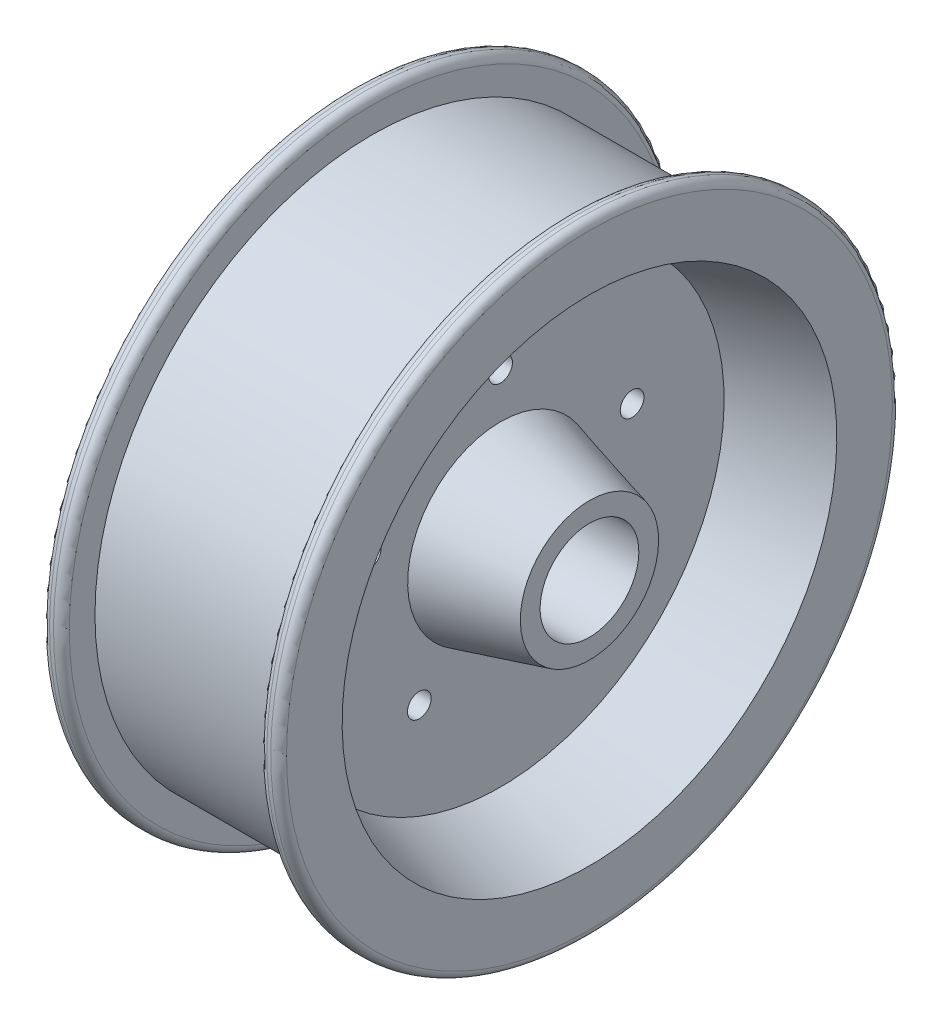
ISO-10303-21;
HEADER;
FILE_DESCRIPTION(('STEP AP214'),'2;1');
FILE_NAME('part.step','',(''),(''),'','','');
FILE_SCHEMA(('AUTOMOTIVE_DESIGN { 1 0 10303 214 1 1 1 1 }'));
ENDSEC;
DATA;
#1=APPLICATION_CONTEXT('core data for automotive mechanical design processes');
#2=APPLICATION_PROTOCOL_DEFINITION('international standard','automotive_design',2000,#1);
#3=PRODUCT_CONTEXT('',#1,'mechanical');
#4=PRODUCT('Part','Part','',(#3));
#5=PRODUCT_RELATED_PRODUCT_CATEGORY('part','',(#4));
#6=PRODUCT_DEFINITION_FORMATION('','',#4);
#7=PRODUCT_DEFINITION_CONTEXT('part definition',#1,'design');
#8=PRODUCT_DEFINITION('design','',#6,#7);
#9=PRODUCT_DEFINITION_SHAPE('','',#8);
#10=(LENGTH_UNIT() NAMED_UNIT(*) SI_UNIT(.MILLI.,.METRE.));
#11=(NAMED_UNIT(*) PLANE_ANGLE_UNIT() SI_UNIT($,.RADIAN.));
#12=(NAMED_UNIT(*) SI_UNIT($,.STERADIAN.) SOLID_ANGLE_UNIT());
#13=UNCERTAINTY_MEASURE_WITH_UNIT(LENGTH_MEASURE(1.E-05),#10,'distance_accuracy_value','');
#14=(GEOMETRIC_REPRESENTATION_CONTEXT(3) GLOBAL_UNCERTAINTY_ASSIGNED_CONTEXT((#13)) GLOBAL_UNIT_ASSIGNED_CONTEXT((#10,
#11,#12)) REPRESENTATION_CONTEXT('',''));
#15=CARTESIAN_POINT('',(0.,0.,0.));
#16=DIRECTION('',(0.,0.,1.));
#17=DIRECTION('',(1.,0.,0.));
#18=AXIS2_PLACEMENT_3D('',#15,#16,#17);
#19=CARTESIAN_POINT('',(38.1,0.,0.));
#20=DIRECTION('',(1.,0.,0.));
#21=DIRECTION('',(0.,1.,0.));
#22=AXIS2_PLACEMENT_3D('',#19,#20,#21);
#23=PLANE('',#22);
#24=CARTESIAN_POINT('',(38.1,20.9836180679051,0.));
#25=DIRECTION('',(1.,0.,0.));
#26=DIRECTION('',(0.,1.,0.));
#27=AXIS2_PLACEMENT_3D('',#24,#25,#26);
#28=CIRCLE('',#27,97.4049729017436);
#29=CARTESIAN_POINT('',(38.1,118.388590969649,0.));
#30=VERTEX_POINT('',#29);
#31=EDGE_CURVE('E10',#30,#30,#28,.T.);
#32=ORIENTED_EDGE('',*,*,#31,.T.);
#33=EDGE_LOOP('',(#32));
#34=FACE_BOUND('',#33,.T.);
#35=CARTESIAN_POINT('',(38.1,20.9836180679051,0.));
#36=DIRECTION('',(1.,0.,0.));
#37=DIRECTION('',(0.,1.,0.));
#38=AXIS2_PLACEMENT_3D('',#35,#36,#37);
#39=CIRCLE('',#38,79.5274);
#40=CARTESIAN_POINT('',(38.1,100.511018067905,0.));
#41=VERTEX_POINT('',#40);
#42=EDGE_CURVE('E120',#41,#41,#39,.T.);
#43=ORIENTED_EDGE('',*,*,#42,.F.);
#44=EDGE_LOOP('',(#43));
#45=FACE_BOUND('',#44,.T.);
#46=ADVANCED_FACE('F37',(#34,#45),#23,.T.);
#47=CARTESIAN_POINT('',(35.56,20.9836180679051,0.));
#48=DIRECTION('',(1.,0.,0.));
#49=DIRECTION('',(0.,1.,0.));
#50=AXIS2_PLACEMENT_3D('',#47,#48,#49);
#51=TOROIDAL_SURFACE('',#50,97.4049729017436,2.54);
#52=CARTESIAN_POINT('',(35.56,20.9836180679051,0.));
#53=DIRECTION('',(1.,0.,0.));
#54=DIRECTION('',(0.,1.,0.));
#55=AXIS2_PLACEMENT_3D('',#52,#53,#54);
#56=CIRCLE('',#55,99.9449729017436);
#57=CARTESIAN_POINT('',(35.56,120.928590969649,0.));
#58=VERTEX_POINT('',#57);
#59=EDGE_CURVE('E44',#58,#58,#56,.T.);
#60=ORIENTED_EDGE('',*,*,#59,.T.);
#61=EDGE_LOOP('',(#60));
#62=FACE_BOUND('',#61,.T.);
#63=ORIENTED_EDGE('',*,*,#31,.F.);
#64=EDGE_LOOP('',(#63));
#65=FACE_BOUND('',#64,.T.);
#66=ADVANCED_FACE('F216',(#62,#65),#51,.T.);
#67=CARTESIAN_POINT('',(104.969478070492,20.9836180679051,0.));
#68=DIRECTION('',(1.,0.,0.));
#69=DIRECTION('',(0.,1.,0.));
#70=AXIS2_PLACEMENT_3D('',#67,#68,#69);
#71=CYLINDRICAL_SURFACE('',#70,99.9449729017436);
#72=CARTESIAN_POINT('',(34.29,20.9836180679051,0.));
#73=DIRECTION('',(1.,0.,0.));
#74=DIRECTION('',(0.,1.,0.));
#75=AXIS2_PLACEMENT_3D('',#72,#73,#74);
#76=CIRCLE('',#75,99.9449729017436);
#77=CARTESIAN_POINT('',(34.29,120.928590969649,0.));
#78=VERTEX_POINT('',#77);
#79=EDGE_CURVE('E49',#78,#78,#76,.T.);
#80=ORIENTED_EDGE('',*,*,#79,.T.);
#81=EDGE_LOOP('',(#80));
#82=FACE_BOUND('',#81,.T.);
#83=ORIENTED_EDGE('',*,*,#59,.F.);
#84=EDGE_LOOP('',(#83));
#85=FACE_BOUND('',#84,.T.);
#86=ADVANCED_FACE('F220',(#82,#85),#71,.T.);
#87=CARTESIAN_POINT('',(34.29,20.9836180679051,0.));
#88=DIRECTION('',(1.,0.,0.));
#89=DIRECTION('',(0.,1.,0.));
#90=AXIS2_PLACEMENT_3D('',#87,#88,#89);
#91=TOROIDAL_SURFACE('',#90,97.4049729017436,2.54);
#92=CARTESIAN_POINT('',(31.75,20.9836180679051,0.));
#93=DIRECTION('',(1.,0.,0.));
#94=DIRECTION('',(0.,1.,0.));
#95=AXIS2_PLACEMENT_3D('',#92,#93,#94);
#96=CIRCLE('',#95,97.4049729017436);
#97=CARTESIAN_POINT('',(31.75,118.388590969649,0.));
#98=VERTEX_POINT('',#97);
#99=EDGE_CURVE('E54',#98,#98,#96,.T.);
#100=ORIENTED_EDGE('',*,*,#99,.T.);
#101=EDGE_LOOP('',(#100));
#102=FACE_BOUND('',#101,.T.);
#103=ORIENTED_EDGE('',*,*,#79,.F.);
#104=EDGE_LOOP('',(#103));
#105=FACE_BOUND('',#104,.T.);
#106=ADVANCED_FACE('F386',(#102,#105),#91,.T.);
#107=CARTESIAN_POINT('',(31.75,0.,0.));
#108=DIRECTION('',(-1.,0.,0.));
#109=DIRECTION('',(0.,-1.,0.));
#110=AXIS2_PLACEMENT_3D('',#107,#108,#109);
#111=PLANE('',#110);
#112=CARTESIAN_POINT('',(31.75,20.9836180679051,0.));
#113=DIRECTION('',(1.,0.,0.));
#114=DIRECTION('',(0.,1.,0.));
#115=AXIS2_PLACEMENT_3D('',#112,#113,#114);
#116=CIRCLE('',#115,89.1499729017436);
#117=CARTESIAN_POINT('',(31.75,110.133590969649,0.));
#118=VERTEX_POINT('',#117);
#119=EDGE_CURVE('E60',#118,#118,#116,.T.);
#120=ORIENTED_EDGE('',*,*,#119,.T.);
#121=EDGE_LOOP('',(#120));
#122=FACE_BOUND('',#121,.T.);
#123=ORIENTED_EDGE('',*,*,#99,.F.);
#124=EDGE_LOOP('',(#123));
#125=FACE_BOUND('',#124,.T.);
#126=ADVANCED_FACE('F376',(#122,#125),#111,.T.);
#127=CARTESIAN_POINT('',(104.969478070492,20.9836180679051,0.));
#128=DIRECTION('',(1.,0.,0.));
#129=DIRECTION('',(0.,1.,0.));
#130=AXIS2_PLACEMENT_3D('',#127,#128,#129);
#131=CYLINDRICAL_SURFACE('',#130,89.1499729017436);
#132=CARTESIAN_POINT('',(-31.75,20.9836180679051,0.));
#133=DIRECTION('',(1.,0.,0.));
#134=DIRECTION('',(0.,1.,0.));
#135=AXIS2_PLACEMENT_3D('',#132,#133,#134);
#136=CIRCLE('',#135,89.1499729017436);
#137=CARTESIAN_POINT('',(-31.75,110.133590969649,0.));
#138=VERTEX_POINT('',#137);
#139=EDGE_CURVE('E64',#138,#138,#136,.T.);
#140=ORIENTED_EDGE('',*,*,#139,.T.);
#141=EDGE_LOOP('',(#140));
#142=FACE_BOUND('',#141,.T.);
#143=ORIENTED_EDGE('',*,*,#119,.F.);
#144=EDGE_LOOP('',(#143));
#145=FACE_BOUND('',#144,.T.);
#146=ADVANCED_FACE('F366',(#142,#145),#131,.T.);
#147=CARTESIAN_POINT('',(-31.75,0.,0.));
#148=DIRECTION('',(-1.,0.,0.));
#149=DIRECTION('',(0.,-1.,0.));
#150=AXIS2_PLACEMENT_3D('',#147,#148,#149);
#151=PLANE('',#150);
#152=ORIENTED_EDGE('',*,*,#139,.F.);
#153=EDGE_LOOP('',(#152));
#154=FACE_BOUND('',#153,.T.);
#155=CARTESIAN_POINT('',(-31.75,20.9836180679051,0.));
#156=DIRECTION('',(1.,0.,0.));
#157=DIRECTION('',(0.,1.,0.));
#158=AXIS2_PLACEMENT_3D('',#155,#156,#157);
#159=CIRCLE('',#158,97.4049729017436);
#160=CARTESIAN_POINT('',(-31.75,118.388590969649,0.));
#161=VERTEX_POINT('',#160);
#162=EDGE_CURVE('E68',#161,#161,#159,.T.);
#163=ORIENTED_EDGE('',*,*,#162,.T.);
#164=EDGE_LOOP('',(#163));
#165=FACE_BOUND('',#164,.T.);
#166=ADVANCED_FACE('F356',(#154,#165),#151,.F.);
#167=CARTESIAN_POINT('',(-34.29,20.9836180679051,0.));
#168=DIRECTION('',(1.,0.,0.));
#169=DIRECTION('',(0.,1.,0.));
#170=AXIS2_PLACEMENT_3D('',#167,#168,#169);
#171=TOROIDAL_SURFACE('',#170,97.4049729017436,2.54);
#172=ORIENTED_EDGE('',*,*,#162,.F.);
#173=EDGE_LOOP('',(#172));
#174=FACE_BOUND('',#173,.T.);
#175=CARTESIAN_POINT('',(-34.29,20.9836180679051,0.));
#176=DIRECTION('',(1.,0.,0.));
#177=DIRECTION('',(0.,1.,0.));
#178=AXIS2_PLACEMENT_3D('',#175,#176,#177);
#179=CIRCLE('',#178,99.9449729017436);
#180=CARTESIAN_POINT('',(-34.29,120.928590969649,0.));
#181=VERTEX_POINT('',#180);
#182=EDGE_CURVE('E72',#181,#181,#179,.T.);
#183=ORIENTED_EDGE('',*,*,#182,.T.);
#184=EDGE_LOOP('',(#183));
#185=FACE_BOUND('',#184,.T.);
#186=ADVANCED_FACE('F346',(#174,#185),#171,.T.);
#187=CARTESIAN_POINT('',(104.969478070492,20.9836180679051,0.));
#188=DIRECTION('',(1.,0.,0.));
#189=DIRECTION('',(0.,1.,0.));
#190=AXIS2_PLACEMENT_3D('',#187,#188,#189);
#191=CYLINDRICAL_SURFACE('',#190,99.9449729017436);
#192=ORIENTED_EDGE('',*,*,#182,.F.);
#193=EDGE_LOOP('',(#192));
#194=FACE_BOUND('',#193,.T.);
#195=CARTESIAN_POINT('',(-35.56,20.9836180679051,0.));
#196=DIRECTION('',(1.,0.,0.));
#197=DIRECTION('',(0.,1.,0.));
#198=AXIS2_PLACEMENT_3D('',#195,#196,#197);
#199=CIRCLE('',#198,99.9449729017436);
#200=CARTESIAN_POINT('',(-35.56,120.928590969649,0.));
#201=VERTEX_POINT('',#200);
#202=EDGE_CURVE('E76',#201,#201,#199,.T.);
#203=ORIENTED_EDGE('',*,*,#202,.T.);
#204=EDGE_LOOP('',(#203));
#205=FACE_BOUND('',#204,.T.);
#206=ADVANCED_FACE('F336',(#194,#205),#191,.T.);
#207=CARTESIAN_POINT('',(-35.56,20.9836180679051,0.));
#208=DIRECTION('',(1.,0.,0.));
#209=DIRECTION('',(0.,1.,0.));
#210=AXIS2_PLACEMENT_3D('',#207,#208,#209);
#211=TOROIDAL_SURFACE('',#210,97.4049729017436,2.54);
#212=ORIENTED_EDGE('',*,*,#202,.F.);
#213=EDGE_LOOP('',(#212));
#214=FACE_BOUND('',#213,.T.);
#215=CARTESIAN_POINT('',(-38.1,20.9836180679051,0.));
#216=DIRECTION('',(1.,0.,0.));
#217=DIRECTION('',(0.,1.,0.));
#218=AXIS2_PLACEMENT_3D('',#215,#216,#217);
#219=CIRCLE('',#218,97.4049729017436);
#220=CARTESIAN_POINT('',(-38.1,118.388590969649,0.));
#221=VERTEX_POINT('',#220);
#222=EDGE_CURVE('E80',#221,#221,#219,.T.);
#223=ORIENTED_EDGE('',*,*,#222,.T.);
#224=EDGE_LOOP('',(#223));
#225=FACE_BOUND('',#224,.T.);
#226=ADVANCED_FACE('F326',(#214,#225),#211,.T.);
#227=CARTESIAN_POINT('',(-38.1,0.,0.));
#228=DIRECTION('',(1.,0.,0.));
#229=DIRECTION('',(0.,1.,0.));
#230=AXIS2_PLACEMENT_3D('',#227,#228,#229);
#231=PLANE('',#230);
#232=ORIENTED_EDGE('',*,*,#222,.F.);
#233=EDGE_LOOP('',(#232));
#234=FACE_BOUND('',#233,.T.);
#235=CARTESIAN_POINT('',(-38.1,20.9836180679051,0.));
#236=DIRECTION('',(1.,0.,0.));
#237=DIRECTION('',(0.,1.,0.));
#238=AXIS2_PLACEMENT_3D('',#235,#236,#237);
#239=CIRCLE('',#238,79.5274);
#240=CARTESIAN_POINT('',(-38.1,100.511018067905,0.));
#241=VERTEX_POINT('',#240);
#242=EDGE_CURVE('E84',#241,#241,#239,.T.);
#243=ORIENTED_EDGE('',*,*,#242,.T.);
#244=EDGE_LOOP('',(#243));
#245=FACE_BOUND('',#244,.T.);
#246=ADVANCED_FACE('F316',(#234,#245),#231,.F.);
#247=CARTESIAN_POINT('',(-9.52500000000001,20.9836180679051,0.));
#248=DIRECTION('',(-1.,0.,0.));
#249=DIRECTION('',(0.,-1.,0.));
#250=AXIS2_PLACEMENT_3D('',#247,#248,#249);
#251=CONICAL_SURFACE('',#250,71.8707518262806,0.261799387799151);
#252=ORIENTED_EDGE('',*,*,#242,.F.);
#253=EDGE_LOOP('',(#252));
#254=FACE_BOUND('',#253,.T.);
#255=CARTESIAN_POINT('',(-9.52500000000001,20.9836180679051,0.));
#256=DIRECTION('',(1.,0.,0.));
#257=DIRECTION('',(0.,1.,0.));
#258=AXIS2_PLACEMENT_3D('',#255,#256,#257);
#259=CIRCLE('',#258,71.8707518262807);
#260=CARTESIAN_POINT('',(-9.52500000000001,92.8543698941858,0.));
#261=VERTEX_POINT('',#260);
#262=EDGE_CURVE('E88',#261,#261,#259,.T.);
#263=ORIENTED_EDGE('',*,*,#262,.T.);
#264=EDGE_LOOP('',(#263));
#265=FACE_BOUND('',#264,.T.);
#266=ADVANCED_FACE('F277',(#254,#265),#251,.F.);
#267=CARTESIAN_POINT('',(-9.525,0.,0.));
#268=DIRECTION('',(1.,0.,0.));
#269=DIRECTION('',(0.,1.,0.));
#270=AXIS2_PLACEMENT_3D('',#267,#268,#269);
#271=PLANE('',#270);
#272=CARTESIAN_POINT('',(-9.525,34.7194234678714,42.2744621493196));
#273=DIRECTION('',(1.,0.,0.));
#274=DIRECTION('',(0.,1.,0.));
#275=AXIS2_PLACEMENT_3D('',#272,#273,#274);
#276=CIRCLE('',#275,3.81);
#277=CARTESIAN_POINT('',(-9.525,38.5294234678714,42.2744621493196));
#278=VERTEX_POINT('',#277);
#279=EDGE_CURVE('E132',#278,#278,#276,.F.);
#280=ORIENTED_EDGE('',*,*,#279,.F.);
#281=EDGE_LOOP('',(#280));
#282=FACE_BOUND('',#281,.T.);
#283=CARTESIAN_POINT('',(-9.525,-14.9771873320615,26.1270544644002));
#284=DIRECTION('',(1.,0.,0.));
#285=DIRECTION('',(0.,1.,0.));
#286=AXIS2_PLACEMENT_3D('',#283,#284,#285);
#287=CIRCLE('',#286,3.81);
#288=CARTESIAN_POINT('',(-9.525,-11.1671873320615,26.1270544644002));
#289=VERTEX_POINT('',#288);
#290=EDGE_CURVE('E150',#289,#289,#287,.F.);
#291=ORIENTED_EDGE('',*,*,#290,.F.);
#292=EDGE_LOOP('',(#291));
#293=FACE_BOUND('',#292,.T.);
#294=CARTESIAN_POINT('',(-9.525,-14.9771873320611,-26.1270544644007));
#295=DIRECTION('',(1.,0.,0.));
#296=DIRECTION('',(0.,1.,0.));
#297=AXIS2_PLACEMENT_3D('',#294,#295,#296);
#298=CIRCLE('',#297,3.81);
#299=CARTESIAN_POINT('',(-9.525,-11.1671873320611,-26.1270544644007));
#300=VERTEX_POINT('',#299);
#301=EDGE_CURVE('E142',#300,#300,#298,.F.);
#302=ORIENTED_EDGE('',*,*,#301,.F.);
#303=EDGE_LOOP('',(#302));
#304=FACE_BOUND('',#303,.T.);
#305=CARTESIAN_POINT('',(-9.525,34.719423467872,-42.2744621493194));
#306=DIRECTION('',(1.,0.,0.));
#307=DIRECTION('',(0.,1.,0.));
#308=AXIS2_PLACEMENT_3D('',#305,#306,#307);
#309=CIRCLE('',#308,3.81);
#310=CARTESIAN_POINT('',(-9.525,38.529423467872,-42.2744621493194));
#311=VERTEX_POINT('',#310);
#312=EDGE_CURVE('E133',#311,#311,#309,.F.);
#313=ORIENTED_EDGE('',*,*,#312,.F.);
#314=EDGE_LOOP('',(#313));
#315=FACE_BOUND('',#314,.T.);
#316=CARTESIAN_POINT('',(-9.52500000000001,65.4336180679051,0.));
#317=DIRECTION('',(1.,0.,0.));
#318=DIRECTION('',(0.,1.,0.));
#319=AXIS2_PLACEMENT_3D('',#316,#317,#318);
#320=CIRCLE('',#319,3.81);
#321=CARTESIAN_POINT('',(-9.52500000000001,69.2436180679051,0.));
#322=VERTEX_POINT('',#321);
#323=EDGE_CURVE('E124',#322,#322,#320,.F.);
#324=ORIENTED_EDGE('',*,*,#323,.F.);
#325=EDGE_LOOP('',(#324));
#326=FACE_BOUND('',#325,.T.);
#327=ORIENTED_EDGE('',*,*,#262,.F.);
#328=EDGE_LOOP('',(#327));
#329=FACE_BOUND('',#328,.T.);
#330=CARTESIAN_POINT('',(-9.52500000000001,20.9836180679051,0.));
#331=DIRECTION('',(1.,0.,0.));
#332=DIRECTION('',(0.,1.,0.));
#333=AXIS2_PLACEMENT_3D('',#330,#331,#332);
#334=CIRCLE('',#333,29.8816481737191);
#335=CARTESIAN_POINT('',(-9.52500000000001,50.8652662416242,0.));
#336=VERTEX_POINT('',#335);
#337=EDGE_CURVE('E92',#336,#336,#334,.T.);
#338=ORIENTED_EDGE('',*,*,#337,.T.);
#339=EDGE_LOOP('',(#338));
#340=FACE_BOUND('',#339,.T.);
#341=ADVANCED_FACE('F211',(#282,#293,#304,#315,#326,#329,#340),#271,.F.);
#342=CARTESIAN_POINT('',(-38.1,20.9836180679051,0.));
#343=DIRECTION('',(1.,0.,0.));
#344=DIRECTION('',(0.,1.,0.));
#345=AXIS2_PLACEMENT_3D('',#342,#343,#344);
#346=CONICAL_SURFACE('',#345,22.225,0.261799387799143);
#347=ORIENTED_EDGE('',*,*,#337,.F.);
#348=EDGE_LOOP('',(#347));
#349=FACE_BOUND('',#348,.T.);
#350=CARTESIAN_POINT('',(-38.1,20.9836180679051,0.));
#351=DIRECTION('',(1.,0.,0.));
#352=DIRECTION('',(0.,1.,0.));
#353=AXIS2_PLACEMENT_3D('',#350,#351,#352);
#354=CIRCLE('',#353,22.225);
#355=CARTESIAN_POINT('',(-38.1,43.2086180679051,0.));
#356=VERTEX_POINT('',#355);
#357=EDGE_CURVE('E96',#356,#356,#354,.T.);
#358=ORIENTED_EDGE('',*,*,#357,.T.);
#359=EDGE_LOOP('',(#358));
#360=FACE_BOUND('',#359,.T.);
#361=ADVANCED_FACE('F205',(#349,#360),#346,.T.);
#362=CARTESIAN_POINT('',(-38.1,0.,0.));
#363=DIRECTION('',(1.,0.,0.));
#364=DIRECTION('',(0.,1.,0.));
#365=AXIS2_PLACEMENT_3D('',#362,#363,#364);
#366=PLANE('',#365);
#367=ORIENTED_EDGE('',*,*,#357,.F.);
#368=EDGE_LOOP('',(#367));
#369=FACE_BOUND('',#368,.T.);
#370=CARTESIAN_POINT('',(-38.1,20.9836180679051,0.));
#371=DIRECTION('',(1.,0.,0.));
#372=DIRECTION('',(0.,1.,0.));
#373=AXIS2_PLACEMENT_3D('',#370,#371,#372);
#374=CIRCLE('',#373,15.875);
#375=CARTESIAN_POINT('',(-38.1,36.8586180679051,0.));
#376=VERTEX_POINT('',#375);
#377=EDGE_CURVE('E100',#376,#376,#374,.T.);
#378=ORIENTED_EDGE('',*,*,#377,.T.);
#379=EDGE_LOOP('',(#378));
#380=FACE_BOUND('',#379,.T.);
#381=ADVANCED_FACE('F200',(#369,#380),#366,.F.);
#382=CARTESIAN_POINT('',(104.969478070492,20.9836180679051,0.));
#383=DIRECTION('',(1.,0.,0.));
#384=DIRECTION('',(0.,1.,0.));
#385=AXIS2_PLACEMENT_3D('',#382,#383,#384);
#386=CYLINDRICAL_SURFACE('',#385,15.875);
#387=CARTESIAN_POINT('',(38.1,20.9836180679051,0.));
#388=DIRECTION('',(1.,0.,0.));
#389=DIRECTION('',(0.,1.,0.));
#390=AXIS2_PLACEMENT_3D('',#387,#388,#389);
#391=CIRCLE('',#390,15.875);
#392=CARTESIAN_POINT('',(38.1,36.8586180679051,0.));
#393=VERTEX_POINT('',#392);
#394=EDGE_CURVE('E104',#393,#393,#391,.T.);
#395=ORIENTED_EDGE('',*,*,#394,.T.);
#396=EDGE_LOOP('',(#395));
#397=FACE_BOUND('',#396,.T.);
#398=ORIENTED_EDGE('',*,*,#377,.F.);
#399=EDGE_LOOP('',(#398));
#400=FACE_BOUND('',#399,.T.);
#401=ADVANCED_FACE('F194',(#397,#400),#386,.F.);
#402=CARTESIAN_POINT('',(38.1,0.,0.));
#403=DIRECTION('',(1.,0.,0.));
#404=DIRECTION('',(0.,1.,0.));
#405=AXIS2_PLACEMENT_3D('',#402,#403,#404);
#406=PLANE('',#405);
#407=CARTESIAN_POINT('',(38.1,20.9836180679051,0.));
#408=DIRECTION('',(1.,0.,0.));
#409=DIRECTION('',(0.,1.,0.));
#410=AXIS2_PLACEMENT_3D('',#407,#408,#409);
#411=CIRCLE('',#410,22.225);
#412=CARTESIAN_POINT('',(38.1,43.2086180679051,0.));
#413=VERTEX_POINT('',#412);
#414=EDGE_CURVE('E108',#413,#413,#411,.T.);
#415=ORIENTED_EDGE('',*,*,#414,.T.);
#416=EDGE_LOOP('',(#415));
#417=FACE_BOUND('',#416,.T.);
#418=ORIENTED_EDGE('',*,*,#394,.F.);
#419=EDGE_LOOP('',(#418));
#420=FACE_BOUND('',#419,.T.);
#421=ADVANCED_FACE('F188',(#417,#420),#406,.T.);
#422=CARTESIAN_POINT('',(38.1,20.9836180679051,0.));
#423=DIRECTION('',(-1.,0.,0.));
#424=DIRECTION('',(0.,-1.,0.));
#425=AXIS2_PLACEMENT_3D('',#422,#423,#424);
#426=CONICAL_SURFACE('',#425,22.225,0.261799387799143);
#427=CARTESIAN_POINT('',(9.52500000000001,20.9836180679051,0.));
#428=DIRECTION('',(1.,0.,0.));
#429=DIRECTION('',(0.,1.,0.));
#430=AXIS2_PLACEMENT_3D('',#427,#428,#429);
#431=CIRCLE('',#430,29.8816481737191);
#432=CARTESIAN_POINT('',(9.525,50.8652662416242,0.));
#433=VERTEX_POINT('',#432);
#434=EDGE_CURVE('E112',#433,#433,#431,.T.);
#435=ORIENTED_EDGE('',*,*,#434,.T.);
#436=EDGE_LOOP('',(#435));
#437=FACE_BOUND('',#436,.T.);
#438=ORIENTED_EDGE('',*,*,#414,.F.);
#439=EDGE_LOOP('',(#438));
#440=FACE_BOUND('',#439,.T.);
#441=ADVANCED_FACE('F172',(#437,#440),#426,.T.);
#442=CARTESIAN_POINT('',(9.52500000000001,0.,0.));
#443=DIRECTION('',(1.,0.,0.));
#444=DIRECTION('',(0.,1.,0.));
#445=AXIS2_PLACEMENT_3D('',#442,#443,#444);
#446=PLANE('',#445);
#447=CARTESIAN_POINT('',(9.52500000000001,34.7194234678714,42.2744621493196));
#448=DIRECTION('',(1.,0.,0.));
#449=DIRECTION('',(0.,0.309016994374945,0.951056516295155));
#450=AXIS2_PLACEMENT_3D('',#447,#448,#449);
#451=CIRCLE('',#450,3.81);
#452=CARTESIAN_POINT('',(9.52500000000001,35.8967782164399,45.8979874764042));
#453=VERTEX_POINT('',#452);
#454=EDGE_CURVE('E154',#453,#453,#451,.T.);
#455=ORIENTED_EDGE('',*,*,#454,.F.);
#456=EDGE_LOOP('',(#455));
#457=FACE_BOUND('',#456,.T.);
#458=CARTESIAN_POINT('',(9.52500000000002,-14.9771873320615,26.1270544644002));
#459=DIRECTION('',(1.,0.,0.));
#460=DIRECTION('',(0.,-0.809016994374951,0.587785252292469));
#461=AXIS2_PLACEMENT_3D('',#458,#459,#460);
#462=CIRCLE('',#461,3.81);
#463=CARTESIAN_POINT('',(9.52500000000002,-18.05954208063,28.3665162756345));
#464=VERTEX_POINT('',#463);
#465=EDGE_CURVE('E146',#464,#464,#462,.T.);
#466=ORIENTED_EDGE('',*,*,#465,.F.);
#467=EDGE_LOOP('',(#466));
#468=FACE_BOUND('',#467,.T.);
#469=CARTESIAN_POINT('',(9.52500000000002,-14.9771873320611,-26.1270544644007));
#470=DIRECTION('',(1.,0.,0.));
#471=DIRECTION('',(0.,-0.809016994374942,-0.58778525229248));
#472=AXIS2_PLACEMENT_3D('',#469,#470,#471);
#473=CIRCLE('',#472,3.81);
#474=CARTESIAN_POINT('',(9.52500000000002,-18.0595420806296,-28.3665162756351));
#475=VERTEX_POINT('',#474);
#476=EDGE_CURVE('E137',#475,#475,#473,.T.);
#477=ORIENTED_EDGE('',*,*,#476,.F.);
#478=EDGE_LOOP('',(#477));
#479=FACE_BOUND('',#478,.T.);
#480=CARTESIAN_POINT('',(9.52500000000001,34.719423467872,-42.2744621493194));
#481=DIRECTION('',(1.,0.,0.));
#482=DIRECTION('',(0.,0.309016994374958,-0.95105651629515));
#483=AXIS2_PLACEMENT_3D('',#480,#481,#482);
#484=CIRCLE('',#483,3.81);
#485=CARTESIAN_POINT('',(9.52500000000001,35.8967782164406,-45.8979874764039));
#486=VERTEX_POINT('',#485);
#487=EDGE_CURVE('E138',#486,#486,#484,.T.);
#488=ORIENTED_EDGE('',*,*,#487,.F.);
#489=EDGE_LOOP('',(#488));
#490=FACE_BOUND('',#489,.T.);
#491=CARTESIAN_POINT('',(9.52500000000001,65.4336180679051,0.));
#492=DIRECTION('',(1.,0.,0.));
#493=DIRECTION('',(0.,1.,0.));
#494=AXIS2_PLACEMENT_3D('',#491,#492,#493);
#495=CIRCLE('',#494,3.81);
#496=CARTESIAN_POINT('',(9.52500000000001,69.2436180679051,0.));
#497=VERTEX_POINT('',#496);
#498=EDGE_CURVE('E128',#497,#497,#495,.T.);
#499=ORIENTED_EDGE('',*,*,#498,.F.);
#500=EDGE_LOOP('',(#499));
#501=FACE_BOUND('',#500,.T.);
#502=CARTESIAN_POINT('',(9.52500000000001,20.9836180679051,0.));
#503=DIRECTION('',(1.,0.,0.));
#504=DIRECTION('',(0.,1.,0.));
#505=AXIS2_PLACEMENT_3D('',#502,#503,#504);
#506=CIRCLE('',#505,71.8707518262807);
#507=CARTESIAN_POINT('',(9.525,92.8543698941858,0.));
#508=VERTEX_POINT('',#507);
#509=EDGE_CURVE('E116',#508,#508,#506,.T.);
#510=ORIENTED_EDGE('',*,*,#509,.T.);
#511=EDGE_LOOP('',(#510));
#512=FACE_BOUND('',#511,.T.);
#513=ORIENTED_EDGE('',*,*,#434,.F.);
#514=EDGE_LOOP('',(#513));
#515=FACE_BOUND('',#514,.T.);
#516=ADVANCED_FACE('F168',(#457,#468,#479,#490,#501,#512,#515),#446,.T.);
#517=CARTESIAN_POINT('',(9.52500000000001,20.9836180679051,0.));
#518=DIRECTION('',(1.,0.,0.));
#519=DIRECTION('',(0.,1.,0.));
#520=AXIS2_PLACEMENT_3D('',#517,#518,#519);
#521=CONICAL_SURFACE('',#520,71.8707518262806,0.26179938779915);
#522=ORIENTED_EDGE('',*,*,#42,.T.);
#523=EDGE_LOOP('',(#522));
#524=FACE_BOUND('',#523,.T.);
#525=ORIENTED_EDGE('',*,*,#509,.F.);
#526=EDGE_LOOP('',(#525));
#527=FACE_BOUND('',#526,.T.);
#528=ADVANCED_FACE('F171',(#524,#527),#521,.F.);
#529=CARTESIAN_POINT('',(-38.101,65.4336180679051,0.));
#530=DIRECTION('',(1.,0.,0.));
#531=DIRECTION('',(0.,1.,0.));
#532=AXIS2_PLACEMENT_3D('',#529,#530,#531);
#533=CYLINDRICAL_SURFACE('',#532,3.81);
#534=ORIENTED_EDGE('',*,*,#498,.T.);
#535=EDGE_LOOP('',(#534));
#536=FACE_BOUND('',#535,.T.);
#537=ORIENTED_EDGE('',*,*,#323,.T.);
#538=EDGE_LOOP('',(#537));
#539=FACE_BOUND('',#538,.T.);
#540=ADVANCED_FACE('F226',(#536,#539),#533,.F.);
#541=CARTESIAN_POINT('',(-38.101,34.719423467872,-42.2744621493194));
#542=DIRECTION('',(1.,0.,0.));
#543=DIRECTION('',(0.,1.,0.));
#544=AXIS2_PLACEMENT_3D('',#541,#542,#543);
#545=CYLINDRICAL_SURFACE('',#544,3.81);
#546=ORIENTED_EDGE('',*,*,#487,.T.);
#547=EDGE_LOOP('',(#546));
#548=FACE_BOUND('',#547,.T.);
#549=ORIENTED_EDGE('',*,*,#312,.T.);
#550=EDGE_LOOP('',(#549));
#551=FACE_BOUND('',#550,.T.);
#552=ADVANCED_FACE('F231',(#548,#551),#545,.F.);
#553=CARTESIAN_POINT('',(-38.101,-14.9771873320611,-26.1270544644007));
#554=DIRECTION('',(1.,0.,0.));
#555=DIRECTION('',(0.,1.,0.));
#556=AXIS2_PLACEMENT_3D('',#553,#554,#555);
#557=CYLINDRICAL_SURFACE('',#556,3.81);
#558=ORIENTED_EDGE('',*,*,#476,.T.);
#559=EDGE_LOOP('',(#558));
#560=FACE_BOUND('',#559,.T.);
#561=ORIENTED_EDGE('',*,*,#301,.T.);
#562=EDGE_LOOP('',(#561));
#563=FACE_BOUND('',#562,.T.);
#564=ADVANCED_FACE('F237',(#560,#563),#557,.F.);
#565=CARTESIAN_POINT('',(-38.101,-14.9771873320615,26.1270544644002));
#566=DIRECTION('',(1.,0.,0.));
#567=DIRECTION('',(0.,1.,0.));
#568=AXIS2_PLACEMENT_3D('',#565,#566,#567);
#569=CYLINDRICAL_SURFACE('',#568,3.81);
#570=ORIENTED_EDGE('',*,*,#465,.T.);
#571=EDGE_LOOP('',(#570));
#572=FACE_BOUND('',#571,.T.);
#573=ORIENTED_EDGE('',*,*,#290,.T.);
#574=EDGE_LOOP('',(#573));
#575=FACE_BOUND('',#574,.T.);
#576=ADVANCED_FACE('F241',(#572,#575),#569,.F.);
#577=CARTESIAN_POINT('',(-38.101,34.7194234678714,42.2744621493196));
#578=DIRECTION('',(1.,0.,0.));
#579=DIRECTION('',(0.,1.,0.));
#580=AXIS2_PLACEMENT_3D('',#577,#578,#579);
#581=CYLINDRICAL_SURFACE('',#580,3.81);
#582=ORIENTED_EDGE('',*,*,#454,.T.);
#583=EDGE_LOOP('',(#582));
#584=FACE_BOUND('',#583,.T.);
#585=ORIENTED_EDGE('',*,*,#279,.T.);
#586=EDGE_LOOP('',(#585));
#587=FACE_BOUND('',#586,.T.);
#588=ADVANCED_FACE('F165',(#584,#587),#581,.F.);
#589=CLOSED_SHELL('',(#46,#66,#86,#106,#126,#146,#166,#186,#206,#226,#246,#266,#341,#361,#381,
#401,#421,#441,#516,#528,#540,#552,#564,#576,#588));
#590=MANIFOLD_SOLID_BREP('B2',#589);
#591=ADVANCED_BREP_SHAPE_REPRESENTATION('',(#18,#590),#14);
#592=SHAPE_DEFINITION_REPRESENTATION(#9,#591);
ENDSEC;
END-ISO-10303-21;
